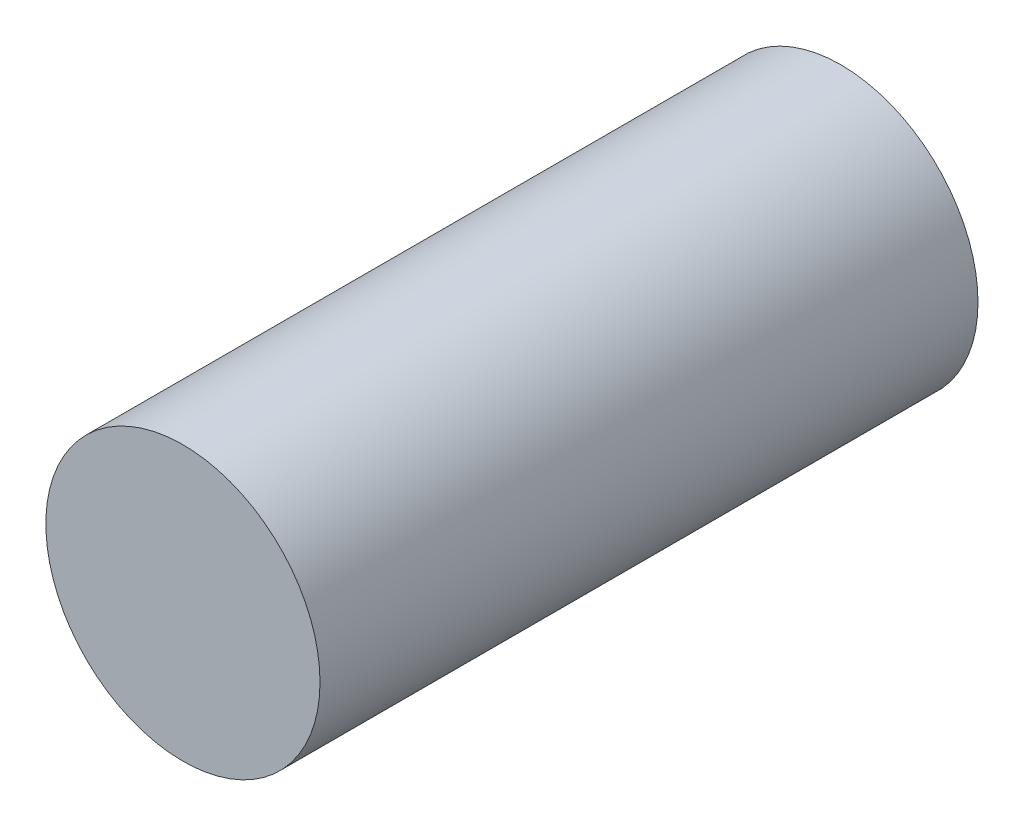
ISO-10303-21;
HEADER;
FILE_DESCRIPTION(('STEP AP214'),'2;1');
FILE_NAME('part.step','',(''),(''),'','','');
FILE_SCHEMA(('AUTOMOTIVE_DESIGN { 1 0 10303 214 1 1 1 1 }'));
ENDSEC;
DATA;
#1=APPLICATION_CONTEXT('core data for automotive mechanical design processes');
#2=APPLICATION_PROTOCOL_DEFINITION('international standard','automotive_design',2000,#1);
#3=PRODUCT_CONTEXT('',#1,'mechanical');
#4=PRODUCT('Part','Part','',(#3));
#5=PRODUCT_RELATED_PRODUCT_CATEGORY('part','',(#4));
#6=PRODUCT_DEFINITION_FORMATION('','',#4);
#7=PRODUCT_DEFINITION_CONTEXT('part definition',#1,'design');
#8=PRODUCT_DEFINITION('design','',#6,#7);
#9=PRODUCT_DEFINITION_SHAPE('','',#8);
#10=(LENGTH_UNIT() NAMED_UNIT(*) SI_UNIT(.MILLI.,.METRE.));
#11=(NAMED_UNIT(*) PLANE_ANGLE_UNIT() SI_UNIT($,.RADIAN.));
#12=(NAMED_UNIT(*) SI_UNIT($,.STERADIAN.) SOLID_ANGLE_UNIT());
#13=UNCERTAINTY_MEASURE_WITH_UNIT(LENGTH_MEASURE(1.E-05),#10,'distance_accuracy_value','');
#14=(GEOMETRIC_REPRESENTATION_CONTEXT(3) GLOBAL_UNCERTAINTY_ASSIGNED_CONTEXT((#13)) GLOBAL_UNIT_ASSIGNED_CONTEXT((#10,
#11,#12)) REPRESENTATION_CONTEXT('',''));
#15=CARTESIAN_POINT('',(0.,0.,0.));
#16=DIRECTION('',(0.,0.,1.));
#17=DIRECTION('',(1.,0.,0.));
#18=AXIS2_PLACEMENT_3D('',#15,#16,#17);
#19=CARTESIAN_POINT('',(28.,7.30000000000002,-17.6066017177982));
#20=DIRECTION('',(0.,0.,1.));
#21=DIRECTION('',(1.,0.,0.));
#22=AXIS2_PLACEMENT_3D('',#19,#20,#21);
#23=CYLINDRICAL_SURFACE('',#22,3.75);
#24=CARTESIAN_POINT('',(28.,7.30000000000002,-7.00000000000002));
#25=DIRECTION('',(0.,0.,-1.));
#26=DIRECTION('',(-1.,0.,0.));
#27=AXIS2_PLACEMENT_3D('',#24,#25,#26);
#28=CIRCLE('',#27,3.75);
#29=CARTESIAN_POINT('',(24.25,7.30000000000002,-7.00000000000002));
#30=VERTEX_POINT('',#29);
#31=EDGE_CURVE('E10',#30,#30,#28,.F.);
#32=ORIENTED_EDGE('',*,*,#31,.T.);
#33=EDGE_LOOP('',(#32));
#34=FACE_BOUND('',#33,.T.);
#35=CARTESIAN_POINT('',(28.,7.30000000000002,11.));
#36=DIRECTION('',(0.,0.,1.));
#37=DIRECTION('',(1.,0.,0.));
#38=AXIS2_PLACEMENT_3D('',#35,#36,#37);
#39=CIRCLE('',#38,3.75);
#40=CARTESIAN_POINT('',(31.75,7.30000000000002,11.));
#41=VERTEX_POINT('',#40);
#42=EDGE_CURVE('E34',#41,#41,#39,.T.);
#43=ORIENTED_EDGE('',*,*,#42,.F.);
#44=EDGE_LOOP('',(#43));
#45=FACE_BOUND('',#44,.T.);
#46=ADVANCED_FACE('F28',(#34,#45),#23,.T.);
#47=CARTESIAN_POINT('',(0.,0.,-7.00000000000002));
#48=DIRECTION('',(0.,0.,-1.));
#49=DIRECTION('',(-1.,0.,0.));
#50=AXIS2_PLACEMENT_3D('',#47,#48,#49);
#51=PLANE('',#50);
#52=ORIENTED_EDGE('',*,*,#31,.F.);
#53=EDGE_LOOP('',(#52));
#54=FACE_BOUND('',#53,.T.);
#55=ADVANCED_FACE('F43',(#54),#51,.T.);
#56=CARTESIAN_POINT('',(28.,7.30000000000002,11.));
#57=DIRECTION('',(0.,0.,1.));
#58=DIRECTION('',(1.,0.,0.));
#59=AXIS2_PLACEMENT_3D('',#56,#57,#58);
#60=PLANE('',#59);
#61=ORIENTED_EDGE('',*,*,#42,.T.);
#62=EDGE_LOOP('',(#61));
#63=FACE_BOUND('',#62,.T.);
#64=ADVANCED_FACE('F40',(#63),#60,.T.);
#65=CLOSED_SHELL('',(#46,#55,#64));
#66=MANIFOLD_SOLID_BREP('B2',#65);
#67=ADVANCED_BREP_SHAPE_REPRESENTATION('',(#18,#66),#14);
#68=SHAPE_DEFINITION_REPRESENTATION(#9,#67);
ENDSEC;
END-ISO-10303-21;
